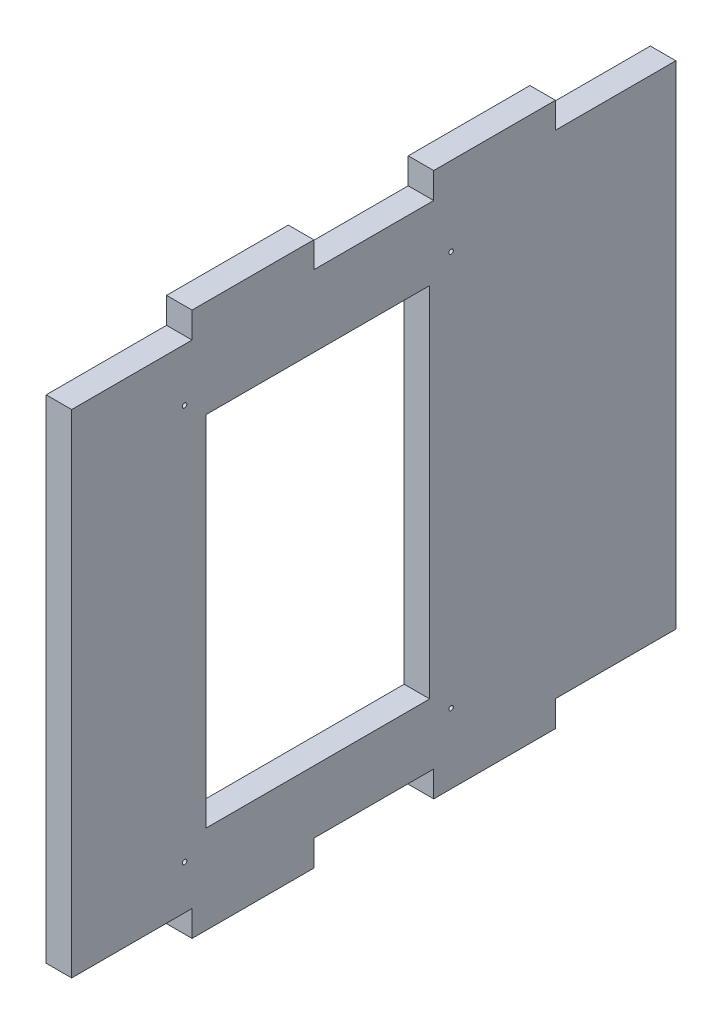
ISO-10303-21;
HEADER;
FILE_DESCRIPTION(('STEP AP214'),'2;1');
FILE_NAME('part.step','',(''),(''),'','','');
FILE_SCHEMA(('AUTOMOTIVE_DESIGN { 1 0 10303 214 1 1 1 1 }'));
ENDSEC;
DATA;
#1=APPLICATION_CONTEXT('core data for automotive mechanical design processes');
#2=APPLICATION_PROTOCOL_DEFINITION('international standard','automotive_design',2000,#1);
#3=PRODUCT_CONTEXT('',#1,'mechanical');
#4=PRODUCT('Part','Part','',(#3));
#5=PRODUCT_RELATED_PRODUCT_CATEGORY('part','',(#4));
#6=PRODUCT_DEFINITION_FORMATION('','',#4);
#7=PRODUCT_DEFINITION_CONTEXT('part definition',#1,'design');
#8=PRODUCT_DEFINITION('design','',#6,#7);
#9=PRODUCT_DEFINITION_SHAPE('','',#8);
#10=(LENGTH_UNIT() NAMED_UNIT(*) SI_UNIT(.MILLI.,.METRE.));
#11=(NAMED_UNIT(*) PLANE_ANGLE_UNIT() SI_UNIT($,.RADIAN.));
#12=(NAMED_UNIT(*) SI_UNIT($,.STERADIAN.) SOLID_ANGLE_UNIT());
#13=UNCERTAINTY_MEASURE_WITH_UNIT(LENGTH_MEASURE(1.E-05),#10,'distance_accuracy_value','');
#14=(GEOMETRIC_REPRESENTATION_CONTEXT(3) GLOBAL_UNCERTAINTY_ASSIGNED_CONTEXT((#13)) GLOBAL_UNIT_ASSIGNED_CONTEXT((#10,
#11,#12)) REPRESENTATION_CONTEXT('',''));
#15=CARTESIAN_POINT('',(0.,0.,0.));
#16=DIRECTION('',(0.,0.,1.));
#17=DIRECTION('',(1.,0.,0.));
#18=AXIS2_PLACEMENT_3D('',#15,#16,#17);
#19=CARTESIAN_POINT('',(5.7,0.,0.));
#20=DIRECTION('',(-1.,0.,0.));
#21=DIRECTION('',(0.,0.,1.));
#22=AXIS2_PLACEMENT_3D('',#19,#20,#21);
#23=PLANE('',#22);
#24=CARTESIAN_POINT('',(5.7,15.83,-84.77));
#25=DIRECTION('',(-1.,0.,0.));
#26=DIRECTION('',(0.,0.,1.));
#27=AXIS2_PLACEMENT_3D('',#24,#25,#26);
#28=CIRCLE('',#27,0.499999999999999);
#29=CARTESIAN_POINT('',(5.7,15.83,-84.27));
#30=VERTEX_POINT('',#29);
#31=EDGE_CURVE('E332',#30,#30,#28,.F.);
#32=ORIENTED_EDGE('',*,*,#31,.F.);
#33=EDGE_LOOP('',(#32));
#34=FACE_BOUND('',#33,.T.);
#35=CARTESIAN_POINT('',(5.7,15.83,-25.23));
#36=DIRECTION('',(-1.,0.,0.));
#37=DIRECTION('',(0.,0.,1.));
#38=AXIS2_PLACEMENT_3D('',#35,#36,#37);
#39=CIRCLE('',#38,0.499999999999999);
#40=CARTESIAN_POINT('',(5.7,15.83,-24.73));
#41=VERTEX_POINT('',#40);
#42=EDGE_CURVE('E338',#41,#41,#39,.F.);
#43=ORIENTED_EDGE('',*,*,#42,.F.);
#44=EDGE_LOOP('',(#43));
#45=FACE_BOUND('',#44,.T.);
#46=CARTESIAN_POINT('',(5.7,104.17,-84.77));
#47=DIRECTION('',(-1.,0.,0.));
#48=DIRECTION('',(0.,0.,1.));
#49=AXIS2_PLACEMENT_3D('',#46,#47,#48);
#50=CIRCLE('',#49,0.499999999999999);
#51=CARTESIAN_POINT('',(5.7,104.17,-84.27));
#52=VERTEX_POINT('',#51);
#53=EDGE_CURVE('E344',#52,#52,#50,.F.);
#54=ORIENTED_EDGE('',*,*,#53,.F.);
#55=EDGE_LOOP('',(#54));
#56=FACE_BOUND('',#55,.T.);
#57=CARTESIAN_POINT('',(5.7,104.17,-25.23));
#58=DIRECTION('',(-1.,0.,0.));
#59=DIRECTION('',(0.,0.,1.));
#60=AXIS2_PLACEMENT_3D('',#57,#58,#59);
#61=CIRCLE('',#60,0.499999999999999);
#62=CARTESIAN_POINT('',(5.7,104.17,-24.73));
#63=VERTEX_POINT('',#62);
#64=EDGE_CURVE('E350',#63,#63,#61,.F.);
#65=ORIENTED_EDGE('',*,*,#64,.F.);
#66=EDGE_LOOP('',(#65));
#67=FACE_BOUND('',#66,.T.);
#68=DIRECTION('',(0.,-1.,0.));
#69=VECTOR('',#68,1.);
#70=CARTESIAN_POINT('',(5.7,0.,-30.));
#71=LINE('',#70,#69);
#72=CARTESIAN_POINT('',(5.7,100.,-30.));
#73=VERTEX_POINT('',#72);
#74=CARTESIAN_POINT('',(5.7,20.,-30.));
#75=VERTEX_POINT('',#74);
#76=EDGE_CURVE('E381',#73,#75,#71,.T.);
#77=ORIENTED_EDGE('',*,*,#76,.F.);
#78=DIRECTION('',(0.,0.,1.));
#79=VECTOR('',#78,1.);
#80=CARTESIAN_POINT('',(5.7,100.,0.));
#81=LINE('',#80,#79);
#82=CARTESIAN_POINT('',(5.7,100.,-80.));
#83=VERTEX_POINT('',#82);
#84=EDGE_CURVE('E374',#83,#73,#81,.T.);
#85=ORIENTED_EDGE('',*,*,#84,.F.);
#86=DIRECTION('',(0.,1.,0.));
#87=VECTOR('',#86,1.);
#88=CARTESIAN_POINT('',(5.7,0.,-80.));
#89=LINE('',#88,#87);
#90=CARTESIAN_POINT('',(5.7,20.,-80.));
#91=VERTEX_POINT('',#90);
#92=EDGE_CURVE('E376',#91,#83,#89,.T.);
#93=ORIENTED_EDGE('',*,*,#92,.F.);
#94=DIRECTION('',(0.,0.,-1.));
#95=VECTOR('',#94,1.);
#96=CARTESIAN_POINT('',(5.7,20.,0.));
#97=LINE('',#96,#95);
#98=EDGE_CURVE('E379',#75,#91,#97,.T.);
#99=ORIENTED_EDGE('',*,*,#98,.F.);
#100=EDGE_LOOP('',(#77,#85,#93,#99));
#101=FACE_BOUND('',#100,.T.);
#102=DIRECTION('',(0.,0.,-1.));
#103=VECTOR('',#102,1.);
#104=CARTESIAN_POINT('',(5.70000000000001,5.99999999999999,0.));
#105=LINE('',#104,#103);
#106=CARTESIAN_POINT('',(5.70000000000001,5.99999999999999,0.));
#107=VERTEX_POINT('',#106);
#108=CARTESIAN_POINT('',(5.70000000000001,5.99999999999999,-26.9));
#109=VERTEX_POINT('',#108);
#110=EDGE_CURVE('E254',#107,#109,#105,.T.);
#111=ORIENTED_EDGE('',*,*,#110,.T.);
#112=DIRECTION('',(0.,-1.,0.));
#113=VECTOR('',#112,1.);
#114=CARTESIAN_POINT('',(5.70000000000001,5.99999999999999,-26.9));
#115=LINE('',#114,#113);
#116=CARTESIAN_POINT('',(5.70000000000001,0.199999999999992,-26.9));
#117=VERTEX_POINT('',#116);
#118=EDGE_CURVE('E437',#109,#117,#115,.T.);
#119=ORIENTED_EDGE('',*,*,#118,.T.);
#120=DIRECTION('',(0.,0.,-1.));
#121=VECTOR('',#120,1.);
#122=CARTESIAN_POINT('',(5.70000000000001,0.199999999999992,-26.9));
#123=LINE('',#122,#121);
#124=CARTESIAN_POINT('',(5.70000000000001,0.199999999999992,-54.1));
#125=VERTEX_POINT('',#124);
#126=EDGE_CURVE('E440',#117,#125,#123,.T.);
#127=ORIENTED_EDGE('',*,*,#126,.T.);
#128=DIRECTION('',(0.,1.,0.));
#129=VECTOR('',#128,1.);
#130=CARTESIAN_POINT('',(5.70000000000001,0.199999999999992,-54.1));
#131=LINE('',#130,#129);
#132=CARTESIAN_POINT('',(5.70000000000001,5.99999999999999,-54.1));
#133=VERTEX_POINT('',#132);
#134=EDGE_CURVE('E444',#125,#133,#131,.T.);
#135=ORIENTED_EDGE('',*,*,#134,.T.);
#136=DIRECTION('',(0.,0.,-1.));
#137=VECTOR('',#136,1.);
#138=CARTESIAN_POINT('',(5.70000000000001,5.99999999999999,-54.1));
#139=LINE('',#138,#137);
#140=CARTESIAN_POINT('',(5.70000000000001,5.99999999999999,-80.9));
#141=VERTEX_POINT('',#140);
#142=EDGE_CURVE('E447',#133,#141,#139,.T.);
#143=ORIENTED_EDGE('',*,*,#142,.T.);
#144=DIRECTION('',(0.,-1.,0.));
#145=VECTOR('',#144,1.);
#146=CARTESIAN_POINT('',(5.70000000000001,5.99999999999999,-80.9));
#147=LINE('',#146,#145);
#148=CARTESIAN_POINT('',(5.70000000000001,0.199999999999992,-80.9));
#149=VERTEX_POINT('',#148);
#150=EDGE_CURVE('E450',#141,#149,#147,.T.);
#151=ORIENTED_EDGE('',*,*,#150,.T.);
#152=DIRECTION('',(0.,0.,-1.));
#153=VECTOR('',#152,1.);
#154=CARTESIAN_POINT('',(5.70000000000001,0.199999999999992,-80.9));
#155=LINE('',#154,#153);
#156=CARTESIAN_POINT('',(5.70000000000001,0.199999999999992,-108.1));
#157=VERTEX_POINT('',#156);
#158=EDGE_CURVE('E453',#149,#157,#155,.T.);
#159=ORIENTED_EDGE('',*,*,#158,.T.);
#160=DIRECTION('',(0.,1.,0.));
#161=VECTOR('',#160,1.);
#162=CARTESIAN_POINT('',(5.70000000000001,0.199999999999992,-108.1));
#163=LINE('',#162,#161);
#164=CARTESIAN_POINT('',(5.70000000000001,5.99999999999999,-108.1));
#165=VERTEX_POINT('',#164);
#166=EDGE_CURVE('E455',#157,#165,#163,.T.);
#167=ORIENTED_EDGE('',*,*,#166,.T.);
#168=DIRECTION('',(0.,0.,-1.));
#169=VECTOR('',#168,1.);
#170=CARTESIAN_POINT('',(5.70000000000001,5.99999999999999,-108.1));
#171=LINE('',#170,#169);
#172=CARTESIAN_POINT('',(5.70000000000001,5.99999999999999,-135.));
#173=VERTEX_POINT('',#172);
#174=EDGE_CURVE('E197',#165,#173,#171,.T.);
#175=ORIENTED_EDGE('',*,*,#174,.T.);
#176=DIRECTION('',(0.,1.,0.));
#177=VECTOR('',#176,1.);
#178=CARTESIAN_POINT('',(5.7,0.,-135.));
#179=LINE('',#178,#177);
#180=CARTESIAN_POINT('',(5.7,116.,-135.));
#181=VERTEX_POINT('',#180);
#182=EDGE_CURVE('E11',#173,#181,#179,.T.);
#183=ORIENTED_EDGE('',*,*,#182,.T.);
#184=DIRECTION('',(0.,0.,1.));
#185=VECTOR('',#184,1.);
#186=CARTESIAN_POINT('',(5.70000000000001,116.,-108.1));
#187=LINE('',#186,#185);
#188=CARTESIAN_POINT('',(5.70000000000001,116.,-108.1));
#189=VERTEX_POINT('',#188);
#190=EDGE_CURVE('E255',#181,#189,#187,.T.);
#191=ORIENTED_EDGE('',*,*,#190,.T.);
#192=DIRECTION('',(0.,1.,0.));
#193=VECTOR('',#192,1.);
#194=CARTESIAN_POINT('',(5.70000000000001,121.8,-108.1));
#195=LINE('',#194,#193);
#196=CARTESIAN_POINT('',(5.70000000000001,121.8,-108.1));
#197=VERTEX_POINT('',#196);
#198=EDGE_CURVE('E257',#189,#197,#195,.T.);
#199=ORIENTED_EDGE('',*,*,#198,.T.);
#200=DIRECTION('',(0.,0.,1.));
#201=VECTOR('',#200,1.);
#202=CARTESIAN_POINT('',(5.70000000000001,121.8,-80.9));
#203=LINE('',#202,#201);
#204=CARTESIAN_POINT('',(5.70000000000001,121.8,-80.9));
#205=VERTEX_POINT('',#204);
#206=EDGE_CURVE('E261',#197,#205,#203,.T.);
#207=ORIENTED_EDGE('',*,*,#206,.T.);
#208=DIRECTION('',(0.,-1.,0.));
#209=VECTOR('',#208,1.);
#210=CARTESIAN_POINT('',(5.70000000000001,116.,-80.9));
#211=LINE('',#210,#209);
#212=CARTESIAN_POINT('',(5.70000000000001,116.,-80.9));
#213=VERTEX_POINT('',#212);
#214=EDGE_CURVE('E264',#205,#213,#211,.T.);
#215=ORIENTED_EDGE('',*,*,#214,.T.);
#216=DIRECTION('',(0.,0.,1.));
#217=VECTOR('',#216,1.);
#218=CARTESIAN_POINT('',(5.70000000000001,116.,-54.1));
#219=LINE('',#218,#217);
#220=CARTESIAN_POINT('',(5.70000000000001,116.,-54.1));
#221=VERTEX_POINT('',#220);
#222=EDGE_CURVE('E267',#213,#221,#219,.T.);
#223=ORIENTED_EDGE('',*,*,#222,.T.);
#224=DIRECTION('',(0.,1.,0.));
#225=VECTOR('',#224,1.);
#226=CARTESIAN_POINT('',(5.70000000000001,121.8,-54.1));
#227=LINE('',#226,#225);
#228=CARTESIAN_POINT('',(5.70000000000001,121.8,-54.1));
#229=VERTEX_POINT('',#228);
#230=EDGE_CURVE('E270',#221,#229,#227,.T.);
#231=ORIENTED_EDGE('',*,*,#230,.T.);
#232=DIRECTION('',(0.,0.,1.));
#233=VECTOR('',#232,1.);
#234=CARTESIAN_POINT('',(5.70000000000001,121.8,-26.9));
#235=LINE('',#234,#233);
#236=CARTESIAN_POINT('',(5.70000000000001,121.8,-26.9));
#237=VERTEX_POINT('',#236);
#238=EDGE_CURVE('E273',#229,#237,#235,.T.);
#239=ORIENTED_EDGE('',*,*,#238,.T.);
#240=DIRECTION('',(0.,-1.,0.));
#241=VECTOR('',#240,1.);
#242=CARTESIAN_POINT('',(5.70000000000001,116.,-26.9));
#243=LINE('',#242,#241);
#244=CARTESIAN_POINT('',(5.70000000000001,116.,-26.9));
#245=VERTEX_POINT('',#244);
#246=EDGE_CURVE('E276',#237,#245,#243,.T.);
#247=ORIENTED_EDGE('',*,*,#246,.T.);
#248=DIRECTION('',(0.,0.,1.));
#249=VECTOR('',#248,1.);
#250=CARTESIAN_POINT('',(5.70000000000001,116.,0.));
#251=LINE('',#250,#249);
#252=CARTESIAN_POINT('',(5.70000000000001,116.,0.));
#253=VERTEX_POINT('',#252);
#254=EDGE_CURVE('E279',#245,#253,#251,.T.);
#255=ORIENTED_EDGE('',*,*,#254,.T.);
#256=DIRECTION('',(0.,-1.,0.));
#257=VECTOR('',#256,1.);
#258=CARTESIAN_POINT('',(5.7,0.,0.));
#259=LINE('',#258,#257);
#260=EDGE_CURVE('E42',#253,#107,#259,.T.);
#261=ORIENTED_EDGE('',*,*,#260,.T.);
#262=EDGE_LOOP('',(#111,#119,#127,#135,#143,#151,#159,#167,#175,#183,#191,#199,#207,#215,#223,
#231,#239,#247,#255,#261));
#263=FACE_BOUND('',#262,.T.);
#264=ADVANCED_FACE('F33',(#34,#45,#56,#67,#101,#263),#23,.F.);
#265=CARTESIAN_POINT('',(0.,0.,0.));
#266=DIRECTION('',(-1.,0.,0.));
#267=DIRECTION('',(0.,0.,1.));
#268=AXIS2_PLACEMENT_3D('',#265,#266,#267);
#269=PLANE('',#268);
#270=CARTESIAN_POINT('',(0.,15.83,-84.77));
#271=DIRECTION('',(1.,0.,0.));
#272=DIRECTION('',(0.,0.,-1.));
#273=AXIS2_PLACEMENT_3D('',#270,#271,#272);
#274=CIRCLE('',#273,0.499999999999999);
#275=CARTESIAN_POINT('',(0.,15.83,-85.27));
#276=VERTEX_POINT('',#275);
#277=EDGE_CURVE('E282',#276,#276,#274,.T.);
#278=ORIENTED_EDGE('',*,*,#277,.T.);
#279=EDGE_LOOP('',(#278));
#280=FACE_BOUND('',#279,.T.);
#281=CARTESIAN_POINT('',(0.,15.83,-25.23));
#282=DIRECTION('',(1.,0.,0.));
#283=DIRECTION('',(0.,0.,-1.));
#284=AXIS2_PLACEMENT_3D('',#281,#282,#283);
#285=CIRCLE('',#284,0.499999999999999);
#286=CARTESIAN_POINT('',(0.,15.83,-25.73));
#287=VERTEX_POINT('',#286);
#288=EDGE_CURVE('E335',#287,#287,#285,.T.);
#289=ORIENTED_EDGE('',*,*,#288,.T.);
#290=EDGE_LOOP('',(#289));
#291=FACE_BOUND('',#290,.T.);
#292=CARTESIAN_POINT('',(0.,104.17,-84.77));
#293=DIRECTION('',(1.,0.,0.));
#294=DIRECTION('',(0.,0.,-1.));
#295=AXIS2_PLACEMENT_3D('',#292,#293,#294);
#296=CIRCLE('',#295,0.499999999999999);
#297=CARTESIAN_POINT('',(0.,104.17,-85.27));
#298=VERTEX_POINT('',#297);
#299=EDGE_CURVE('E341',#298,#298,#296,.T.);
#300=ORIENTED_EDGE('',*,*,#299,.T.);
#301=EDGE_LOOP('',(#300));
#302=FACE_BOUND('',#301,.T.);
#303=CARTESIAN_POINT('',(0.,104.17,-25.23));
#304=DIRECTION('',(1.,0.,0.));
#305=DIRECTION('',(0.,0.,-1.));
#306=AXIS2_PLACEMENT_3D('',#303,#304,#305);
#307=CIRCLE('',#306,0.499999999999999);
#308=CARTESIAN_POINT('',(0.,104.17,-25.73));
#309=VERTEX_POINT('',#308);
#310=EDGE_CURVE('E347',#309,#309,#307,.T.);
#311=ORIENTED_EDGE('',*,*,#310,.T.);
#312=EDGE_LOOP('',(#311));
#313=FACE_BOUND('',#312,.T.);
#314=DIRECTION('',(0.,0.,1.));
#315=VECTOR('',#314,1.);
#316=CARTESIAN_POINT('',(0.,100.,-30.));
#317=LINE('',#316,#315);
#318=CARTESIAN_POINT('',(0.,100.,-80.));
#319=VERTEX_POINT('',#318);
#320=CARTESIAN_POINT('',(0.,100.,-30.));
#321=VERTEX_POINT('',#320);
#322=EDGE_CURVE('E362',#319,#321,#317,.T.);
#323=ORIENTED_EDGE('',*,*,#322,.T.);
#324=DIRECTION('',(0.,-1.,0.));
#325=VECTOR('',#324,1.);
#326=CARTESIAN_POINT('',(0.,100.,-30.));
#327=LINE('',#326,#325);
#328=CARTESIAN_POINT('',(0.,20.,-30.));
#329=VERTEX_POINT('',#328);
#330=EDGE_CURVE('E353',#321,#329,#327,.T.);
#331=ORIENTED_EDGE('',*,*,#330,.T.);
#332=DIRECTION('',(0.,0.,-1.));
#333=VECTOR('',#332,1.);
#334=CARTESIAN_POINT('',(0.,20.,-30.));
#335=LINE('',#334,#333);
#336=CARTESIAN_POINT('',(0.,20.,-80.));
#337=VERTEX_POINT('',#336);
#338=EDGE_CURVE('E356',#329,#337,#335,.T.);
#339=ORIENTED_EDGE('',*,*,#338,.T.);
#340=DIRECTION('',(0.,1.,0.));
#341=VECTOR('',#340,1.);
#342=CARTESIAN_POINT('',(0.,100.,-80.));
#343=LINE('',#342,#341);
#344=EDGE_CURVE('E359',#337,#319,#343,.T.);
#345=ORIENTED_EDGE('',*,*,#344,.T.);
#346=EDGE_LOOP('',(#323,#331,#339,#345));
#347=FACE_BOUND('',#346,.T.);
#348=DIRECTION('',(0.,1.,0.));
#349=VECTOR('',#348,1.);
#350=CARTESIAN_POINT('',(0.,5.99999999999999,-26.9));
#351=LINE('',#350,#349);
#352=CARTESIAN_POINT('',(0.,0.199999999999992,-26.9));
#353=VERTEX_POINT('',#352);
#354=CARTESIAN_POINT('',(0.,5.99999999999999,-26.9));
#355=VERTEX_POINT('',#354);
#356=EDGE_CURVE('E233',#353,#355,#351,.T.);
#357=ORIENTED_EDGE('',*,*,#356,.T.);
#358=DIRECTION('',(0.,0.,1.));
#359=VECTOR('',#358,1.);
#360=CARTESIAN_POINT('',(0.,5.99999999999999,0.));
#361=LINE('',#360,#359);
#362=CARTESIAN_POINT('',(0.,5.99999999999999,0.));
#363=VERTEX_POINT('',#362);
#364=EDGE_CURVE('E235',#355,#363,#361,.T.);
#365=ORIENTED_EDGE('',*,*,#364,.T.);
#366=DIRECTION('',(0.,-1.,0.));
#367=VECTOR('',#366,1.);
#368=CARTESIAN_POINT('',(0.,0.,0.));
#369=LINE('',#368,#367);
#370=CARTESIAN_POINT('',(0.,116.,0.));
#371=VERTEX_POINT('',#370);
#372=EDGE_CURVE('E383',#371,#363,#369,.T.);
#373=ORIENTED_EDGE('',*,*,#372,.F.);
#374=DIRECTION('',(0.,0.,-1.));
#375=VECTOR('',#374,1.);
#376=CARTESIAN_POINT('',(0.,116.,0.));
#377=LINE('',#376,#375);
#378=CARTESIAN_POINT('',(0.,116.,-26.9));
#379=VERTEX_POINT('',#378);
#380=EDGE_CURVE('E283',#371,#379,#377,.T.);
#381=ORIENTED_EDGE('',*,*,#380,.T.);
#382=DIRECTION('',(0.,1.,0.));
#383=VECTOR('',#382,1.);
#384=CARTESIAN_POINT('',(0.,116.,-26.9));
#385=LINE('',#384,#383);
#386=CARTESIAN_POINT('',(0.,121.8,-26.9));
#387=VERTEX_POINT('',#386);
#388=EDGE_CURVE('E286',#379,#387,#385,.T.);
#389=ORIENTED_EDGE('',*,*,#388,.T.);
#390=DIRECTION('',(0.,0.,-1.));
#391=VECTOR('',#390,1.);
#392=CARTESIAN_POINT('',(0.,121.8,-26.9));
#393=LINE('',#392,#391);
#394=CARTESIAN_POINT('',(0.,121.8,-54.1));
#395=VERTEX_POINT('',#394);
#396=EDGE_CURVE('E289',#387,#395,#393,.T.);
#397=ORIENTED_EDGE('',*,*,#396,.T.);
#398=DIRECTION('',(0.,-1.,0.));
#399=VECTOR('',#398,1.);
#400=CARTESIAN_POINT('',(0.,121.8,-54.1));
#401=LINE('',#400,#399);
#402=CARTESIAN_POINT('',(0.,116.,-54.1));
#403=VERTEX_POINT('',#402);
#404=EDGE_CURVE('E292',#395,#403,#401,.T.);
#405=ORIENTED_EDGE('',*,*,#404,.T.);
#406=DIRECTION('',(0.,0.,-1.));
#407=VECTOR('',#406,1.);
#408=CARTESIAN_POINT('',(0.,116.,-54.1));
#409=LINE('',#408,#407);
#410=CARTESIAN_POINT('',(0.,116.,-80.9));
#411=VERTEX_POINT('',#410);
#412=EDGE_CURVE('E295',#403,#411,#409,.T.);
#413=ORIENTED_EDGE('',*,*,#412,.T.);
#414=DIRECTION('',(0.,1.,0.));
#415=VECTOR('',#414,1.);
#416=CARTESIAN_POINT('',(0.,116.,-80.9));
#417=LINE('',#416,#415);
#418=CARTESIAN_POINT('',(0.,121.8,-80.9));
#419=VERTEX_POINT('',#418);
#420=EDGE_CURVE('E298',#411,#419,#417,.T.);
#421=ORIENTED_EDGE('',*,*,#420,.T.);
#422=DIRECTION('',(0.,0.,-1.));
#423=VECTOR('',#422,1.);
#424=CARTESIAN_POINT('',(0.,121.8,-80.9));
#425=LINE('',#424,#423);
#426=CARTESIAN_POINT('',(0.,121.8,-108.1));
#427=VERTEX_POINT('',#426);
#428=EDGE_CURVE('E301',#419,#427,#425,.T.);
#429=ORIENTED_EDGE('',*,*,#428,.T.);
#430=DIRECTION('',(0.,-1.,0.));
#431=VECTOR('',#430,1.);
#432=CARTESIAN_POINT('',(0.,121.8,-108.1));
#433=LINE('',#432,#431);
#434=CARTESIAN_POINT('',(0.,116.,-108.1));
#435=VERTEX_POINT('',#434);
#436=EDGE_CURVE('E304',#427,#435,#433,.T.);
#437=ORIENTED_EDGE('',*,*,#436,.T.);
#438=DIRECTION('',(0.,0.,-1.));
#439=VECTOR('',#438,1.);
#440=CARTESIAN_POINT('',(0.,116.,-108.1));
#441=LINE('',#440,#439);
#442=CARTESIAN_POINT('',(0.,116.,-135.));
#443=VERTEX_POINT('',#442);
#444=EDGE_CURVE('E307',#435,#443,#441,.T.);
#445=ORIENTED_EDGE('',*,*,#444,.T.);
#446=DIRECTION('',(0.,1.,0.));
#447=VECTOR('',#446,1.);
#448=CARTESIAN_POINT('',(0.,0.,-135.));
#449=LINE('',#448,#447);
#450=CARTESIAN_POINT('',(0.,5.99999999999999,-135.));
#451=VERTEX_POINT('',#450);
#452=EDGE_CURVE('E37',#451,#443,#449,.T.);
#453=ORIENTED_EDGE('',*,*,#452,.F.);
#454=DIRECTION('',(0.,0.,1.));
#455=VECTOR('',#454,1.);
#456=CARTESIAN_POINT('',(0.,5.99999999999999,-108.1));
#457=LINE('',#456,#455);
#458=CARTESIAN_POINT('',(0.,5.99999999999999,-108.1));
#459=VERTEX_POINT('',#458);
#460=EDGE_CURVE('E50',#451,#459,#457,.T.);
#461=ORIENTED_EDGE('',*,*,#460,.T.);
#462=DIRECTION('',(0.,-1.,0.));
#463=VECTOR('',#462,1.);
#464=CARTESIAN_POINT('',(0.,0.199999999999992,-108.1));
#465=LINE('',#464,#463);
#466=CARTESIAN_POINT('',(0.,0.199999999999992,-108.1));
#467=VERTEX_POINT('',#466);
#468=EDGE_CURVE('E204',#459,#467,#465,.T.);
#469=ORIENTED_EDGE('',*,*,#468,.T.);
#470=DIRECTION('',(0.,0.,1.));
#471=VECTOR('',#470,1.);
#472=CARTESIAN_POINT('',(0.,0.199999999999992,-80.9));
#473=LINE('',#472,#471);
#474=CARTESIAN_POINT('',(0.,0.199999999999992,-80.9));
#475=VERTEX_POINT('',#474);
#476=EDGE_CURVE('E210',#467,#475,#473,.T.);
#477=ORIENTED_EDGE('',*,*,#476,.T.);
#478=DIRECTION('',(0.,1.,0.));
#479=VECTOR('',#478,1.);
#480=CARTESIAN_POINT('',(0.,5.99999999999999,-80.9));
#481=LINE('',#480,#479);
#482=CARTESIAN_POINT('',(0.,5.99999999999999,-80.9));
#483=VERTEX_POINT('',#482);
#484=EDGE_CURVE('E221',#475,#483,#481,.T.);
#485=ORIENTED_EDGE('',*,*,#484,.T.);
#486=DIRECTION('',(0.,0.,1.));
#487=VECTOR('',#486,1.);
#488=CARTESIAN_POINT('',(0.,5.99999999999999,-54.1));
#489=LINE('',#488,#487);
#490=CARTESIAN_POINT('',(0.,5.99999999999999,-54.1));
#491=VERTEX_POINT('',#490);
#492=EDGE_CURVE('E224',#483,#491,#489,.T.);
#493=ORIENTED_EDGE('',*,*,#492,.T.);
#494=DIRECTION('',(0.,-1.,0.));
#495=VECTOR('',#494,1.);
#496=CARTESIAN_POINT('',(0.,0.199999999999992,-54.1));
#497=LINE('',#496,#495);
#498=CARTESIAN_POINT('',(0.,0.199999999999992,-54.1));
#499=VERTEX_POINT('',#498);
#500=EDGE_CURVE('E227',#491,#499,#497,.T.);
#501=ORIENTED_EDGE('',*,*,#500,.T.);
#502=DIRECTION('',(0.,0.,1.));
#503=VECTOR('',#502,1.);
#504=CARTESIAN_POINT('',(0.,0.199999999999992,-26.9));
#505=LINE('',#504,#503);
#506=EDGE_CURVE('E230',#499,#353,#505,.T.);
#507=ORIENTED_EDGE('',*,*,#506,.T.);
#508=EDGE_LOOP('',(#357,#365,#373,#381,#389,#397,#405,#413,#421,#429,#437,#445,#453,#461,#469,
#477,#485,#493,#501,#507));
#509=FACE_BOUND('',#508,.T.);
#510=ADVANCED_FACE('F214',(#280,#291,#302,#313,#347,#509),#269,.T.);
#511=CARTESIAN_POINT('',(5.7,0.,0.));
#512=DIRECTION('',(0.,0.,-1.));
#513=DIRECTION('',(-1.,0.,0.));
#514=AXIS2_PLACEMENT_3D('',#511,#512,#513);
#515=PLANE('',#514);
#516=DIRECTION('',(-1.,0.,0.));
#517=VECTOR('',#516,1.);
#518=CARTESIAN_POINT('',(141.423984615837,5.99999999999999,0.));
#519=LINE('',#518,#517);
#520=EDGE_CURVE('E238',#107,#363,#519,.T.);
#521=ORIENTED_EDGE('',*,*,#520,.F.);
#522=ORIENTED_EDGE('',*,*,#260,.F.);
#523=DIRECTION('',(-1.,0.,0.));
#524=VECTOR('',#523,1.);
#525=CARTESIAN_POINT('',(141.423984615837,116.,0.));
#526=LINE('',#525,#524);
#527=EDGE_CURVE('E258',#253,#371,#526,.T.);
#528=ORIENTED_EDGE('',*,*,#527,.T.);
#529=ORIENTED_EDGE('',*,*,#372,.T.);
#530=EDGE_LOOP('',(#521,#522,#528,#529));
#531=FACE_BOUND('',#530,.T.);
#532=ADVANCED_FACE('F35',(#531),#515,.F.);
#533=CARTESIAN_POINT('',(5.7,0.,-135.));
#534=DIRECTION('',(0.,0.,1.));
#535=DIRECTION('',(1.,0.,0.));
#536=AXIS2_PLACEMENT_3D('',#533,#534,#535);
#537=PLANE('',#536);
#538=DIRECTION('',(-1.,0.,0.));
#539=VECTOR('',#538,1.);
#540=CARTESIAN_POINT('',(141.423984615837,5.99999999999999,-135.));
#541=LINE('',#540,#539);
#542=EDGE_CURVE('E200',#173,#451,#541,.T.);
#543=ORIENTED_EDGE('',*,*,#542,.T.);
#544=ORIENTED_EDGE('',*,*,#452,.T.);
#545=DIRECTION('',(-1.,0.,0.));
#546=VECTOR('',#545,1.);
#547=CARTESIAN_POINT('',(141.423984615837,116.,-135.));
#548=LINE('',#547,#546);
#549=EDGE_CURVE('E309',#181,#443,#548,.T.);
#550=ORIENTED_EDGE('',*,*,#549,.F.);
#551=ORIENTED_EDGE('',*,*,#182,.F.);
#552=EDGE_LOOP('',(#543,#544,#550,#551));
#553=FACE_BOUND('',#552,.T.);
#554=ADVANCED_FACE('F391',(#553),#537,.F.);
#555=CARTESIAN_POINT('',(70.,100.,-30.));
#556=DIRECTION('',(0.,0.,-1.));
#557=DIRECTION('',(-1.,0.,0.));
#558=AXIS2_PLACEMENT_3D('',#555,#556,#557);
#559=PLANE('',#558);
#560=ORIENTED_EDGE('',*,*,#76,.T.);
#561=DIRECTION('',(-1.,0.,0.));
#562=VECTOR('',#561,1.);
#563=CARTESIAN_POINT('',(70.,20.,-30.));
#564=LINE('',#563,#562);
#565=EDGE_CURVE('E372',#75,#329,#564,.T.);
#566=ORIENTED_EDGE('',*,*,#565,.T.);
#567=ORIENTED_EDGE('',*,*,#330,.F.);
#568=DIRECTION('',(-1.,0.,0.));
#569=VECTOR('',#568,1.);
#570=CARTESIAN_POINT('',(70.,100.,-30.));
#571=LINE('',#570,#569);
#572=EDGE_CURVE('E365',#73,#321,#571,.T.);
#573=ORIENTED_EDGE('',*,*,#572,.F.);
#574=EDGE_LOOP('',(#560,#566,#567,#573));
#575=FACE_BOUND('',#574,.T.);
#576=ADVANCED_FACE('F492',(#575),#559,.T.);
#577=CARTESIAN_POINT('',(70.,20.,-30.));
#578=DIRECTION('',(0.,1.,0.));
#579=DIRECTION('',(0.,0.,1.));
#580=AXIS2_PLACEMENT_3D('',#577,#578,#579);
#581=PLANE('',#580);
#582=ORIENTED_EDGE('',*,*,#98,.T.);
#583=DIRECTION('',(-1.,0.,0.));
#584=VECTOR('',#583,1.);
#585=CARTESIAN_POINT('',(70.,20.,-80.));
#586=LINE('',#585,#584);
#587=EDGE_CURVE('E370',#91,#337,#586,.T.);
#588=ORIENTED_EDGE('',*,*,#587,.T.);
#589=ORIENTED_EDGE('',*,*,#338,.F.);
#590=ORIENTED_EDGE('',*,*,#565,.F.);
#591=EDGE_LOOP('',(#582,#588,#589,#590));
#592=FACE_BOUND('',#591,.T.);
#593=ADVANCED_FACE('F499',(#592),#581,.T.);
#594=CARTESIAN_POINT('',(70.,100.,-80.));
#595=DIRECTION('',(0.,0.,1.));
#596=DIRECTION('',(1.,0.,0.));
#597=AXIS2_PLACEMENT_3D('',#594,#595,#596);
#598=PLANE('',#597);
#599=ORIENTED_EDGE('',*,*,#92,.T.);
#600=DIRECTION('',(-1.,0.,0.));
#601=VECTOR('',#600,1.);
#602=CARTESIAN_POINT('',(70.,100.,-80.));
#603=LINE('',#602,#601);
#604=EDGE_CURVE('E368',#83,#319,#603,.T.);
#605=ORIENTED_EDGE('',*,*,#604,.T.);
#606=ORIENTED_EDGE('',*,*,#344,.F.);
#607=ORIENTED_EDGE('',*,*,#587,.F.);
#608=EDGE_LOOP('',(#599,#605,#606,#607));
#609=FACE_BOUND('',#608,.T.);
#610=ADVANCED_FACE('F564',(#609),#598,.T.);
#611=CARTESIAN_POINT('',(70.,100.,-30.));
#612=DIRECTION('',(0.,-1.,0.));
#613=DIRECTION('',(0.,0.,-1.));
#614=AXIS2_PLACEMENT_3D('',#611,#612,#613);
#615=PLANE('',#614);
#616=ORIENTED_EDGE('',*,*,#84,.T.);
#617=ORIENTED_EDGE('',*,*,#572,.T.);
#618=ORIENTED_EDGE('',*,*,#322,.F.);
#619=ORIENTED_EDGE('',*,*,#604,.F.);
#620=EDGE_LOOP('',(#616,#617,#618,#619));
#621=FACE_BOUND('',#620,.T.);
#622=ADVANCED_FACE('F554',(#621),#615,.T.);
#623=CARTESIAN_POINT('',(52.,104.17,-25.23));
#624=DIRECTION('',(-1.,0.,0.));
#625=DIRECTION('',(0.,0.,1.));
#626=AXIS2_PLACEMENT_3D('',#623,#624,#625);
#627=CYLINDRICAL_SURFACE('',#626,0.499999999999999);
#628=ORIENTED_EDGE('',*,*,#310,.F.);
#629=EDGE_LOOP('',(#628));
#630=FACE_BOUND('',#629,.T.);
#631=ORIENTED_EDGE('',*,*,#64,.T.);
#632=EDGE_LOOP('',(#631));
#633=FACE_BOUND('',#632,.T.);
#634=ADVANCED_FACE('F544',(#630,#633),#627,.F.);
#635=CARTESIAN_POINT('',(52.,104.17,-84.77));
#636=DIRECTION('',(-1.,0.,0.));
#637=DIRECTION('',(0.,0.,1.));
#638=AXIS2_PLACEMENT_3D('',#635,#636,#637);
#639=CYLINDRICAL_SURFACE('',#638,0.499999999999999);
#640=ORIENTED_EDGE('',*,*,#299,.F.);
#641=EDGE_LOOP('',(#640));
#642=FACE_BOUND('',#641,.T.);
#643=ORIENTED_EDGE('',*,*,#53,.T.);
#644=EDGE_LOOP('',(#643));
#645=FACE_BOUND('',#644,.T.);
#646=ADVANCED_FACE('F534',(#642,#645),#639,.F.);
#647=CARTESIAN_POINT('',(52.,15.83,-25.23));
#648=DIRECTION('',(-1.,0.,0.));
#649=DIRECTION('',(0.,0.,1.));
#650=AXIS2_PLACEMENT_3D('',#647,#648,#649);
#651=CYLINDRICAL_SURFACE('',#650,0.499999999999999);
#652=ORIENTED_EDGE('',*,*,#288,.F.);
#653=EDGE_LOOP('',(#652));
#654=FACE_BOUND('',#653,.T.);
#655=ORIENTED_EDGE('',*,*,#42,.T.);
#656=EDGE_LOOP('',(#655));
#657=FACE_BOUND('',#656,.T.);
#658=ADVANCED_FACE('F522',(#654,#657),#651,.F.);
#659=CARTESIAN_POINT('',(52.,15.83,-84.77));
#660=DIRECTION('',(-1.,0.,0.));
#661=DIRECTION('',(0.,0.,1.));
#662=AXIS2_PLACEMENT_3D('',#659,#660,#661);
#663=CYLINDRICAL_SURFACE('',#662,0.499999999999999);
#664=ORIENTED_EDGE('',*,*,#277,.F.);
#665=EDGE_LOOP('',(#664));
#666=FACE_BOUND('',#665,.T.);
#667=ORIENTED_EDGE('',*,*,#31,.T.);
#668=EDGE_LOOP('',(#667));
#669=FACE_BOUND('',#668,.T.);
#670=ADVANCED_FACE('F517',(#666,#669),#663,.F.);
#671=CARTESIAN_POINT('',(141.423984615837,116.,-108.1));
#672=DIRECTION('',(0.,1.,0.));
#673=DIRECTION('',(0.,0.,1.));
#674=AXIS2_PLACEMENT_3D('',#671,#672,#673);
#675=PLANE('',#674);
#676=ORIENTED_EDGE('',*,*,#549,.T.);
#677=ORIENTED_EDGE('',*,*,#444,.F.);
#678=DIRECTION('',(-1.,0.,0.));
#679=VECTOR('',#678,1.);
#680=CARTESIAN_POINT('',(141.423984615837,116.,-108.1));
#681=LINE('',#680,#679);
#682=EDGE_CURVE('E312',#189,#435,#681,.T.);
#683=ORIENTED_EDGE('',*,*,#682,.F.);
#684=ORIENTED_EDGE('',*,*,#190,.F.);
#685=EDGE_LOOP('',(#676,#677,#683,#684));
#686=FACE_BOUND('',#685,.T.);
#687=ADVANCED_FACE('F394',(#686),#675,.T.);
#688=CARTESIAN_POINT('',(141.423984615837,121.8,-108.1));
#689=DIRECTION('',(0.,0.,-1.));
#690=DIRECTION('',(-1.,0.,0.));
#691=AXIS2_PLACEMENT_3D('',#688,#689,#690);
#692=PLANE('',#691);
#693=ORIENTED_EDGE('',*,*,#682,.T.);
#694=ORIENTED_EDGE('',*,*,#436,.F.);
#695=DIRECTION('',(-1.,0.,0.));
#696=VECTOR('',#695,1.);
#697=CARTESIAN_POINT('',(141.423984615837,121.8,-108.1));
#698=LINE('',#697,#696);
#699=EDGE_CURVE('E314',#197,#427,#698,.T.);
#700=ORIENTED_EDGE('',*,*,#699,.F.);
#701=ORIENTED_EDGE('',*,*,#198,.F.);
#702=EDGE_LOOP('',(#693,#694,#700,#701));
#703=FACE_BOUND('',#702,.T.);
#704=ADVANCED_FACE('F400',(#703),#692,.T.);
#705=CARTESIAN_POINT('',(141.423984615837,121.8,-80.9));
#706=DIRECTION('',(0.,1.,0.));
#707=DIRECTION('',(0.,0.,1.));
#708=AXIS2_PLACEMENT_3D('',#705,#706,#707);
#709=PLANE('',#708);
#710=ORIENTED_EDGE('',*,*,#699,.T.);
#711=ORIENTED_EDGE('',*,*,#428,.F.);
#712=DIRECTION('',(-1.,0.,0.));
#713=VECTOR('',#712,1.);
#714=CARTESIAN_POINT('',(141.423984615837,121.8,-80.9));
#715=LINE('',#714,#713);
#716=EDGE_CURVE('E316',#205,#419,#715,.T.);
#717=ORIENTED_EDGE('',*,*,#716,.F.);
#718=ORIENTED_EDGE('',*,*,#206,.F.);
#719=EDGE_LOOP('',(#710,#711,#717,#718));
#720=FACE_BOUND('',#719,.T.);
#721=ADVANCED_FACE('F404',(#720),#709,.T.);
#722=CARTESIAN_POINT('',(141.423984615837,116.,-80.9));
#723=DIRECTION('',(0.,0.,1.));
#724=DIRECTION('',(1.,0.,0.));
#725=AXIS2_PLACEMENT_3D('',#722,#723,#724);
#726=PLANE('',#725);
#727=ORIENTED_EDGE('',*,*,#716,.T.);
#728=ORIENTED_EDGE('',*,*,#420,.F.);
#729=DIRECTION('',(-1.,0.,0.));
#730=VECTOR('',#729,1.);
#731=CARTESIAN_POINT('',(141.423984615837,116.,-80.9));
#732=LINE('',#731,#730);
#733=EDGE_CURVE('E318',#213,#411,#732,.T.);
#734=ORIENTED_EDGE('',*,*,#733,.F.);
#735=ORIENTED_EDGE('',*,*,#214,.F.);
#736=EDGE_LOOP('',(#727,#728,#734,#735));
#737=FACE_BOUND('',#736,.T.);
#738=ADVANCED_FACE('F407',(#737),#726,.T.);
#739=CARTESIAN_POINT('',(141.423984615837,116.,-54.1));
#740=DIRECTION('',(0.,1.,0.));
#741=DIRECTION('',(0.,0.,1.));
#742=AXIS2_PLACEMENT_3D('',#739,#740,#741);
#743=PLANE('',#742);
#744=ORIENTED_EDGE('',*,*,#733,.T.);
#745=ORIENTED_EDGE('',*,*,#412,.F.);
#746=DIRECTION('',(-1.,0.,0.));
#747=VECTOR('',#746,1.);
#748=CARTESIAN_POINT('',(141.423984615837,116.,-54.1));
#749=LINE('',#748,#747);
#750=EDGE_CURVE('E320',#221,#403,#749,.T.);
#751=ORIENTED_EDGE('',*,*,#750,.F.);
#752=ORIENTED_EDGE('',*,*,#222,.F.);
#753=EDGE_LOOP('',(#744,#745,#751,#752));
#754=FACE_BOUND('',#753,.T.);
#755=ADVANCED_FACE('F411',(#754),#743,.T.);
#756=CARTESIAN_POINT('',(141.423984615837,121.8,-54.1));
#757=DIRECTION('',(0.,0.,-1.));
#758=DIRECTION('',(-1.,0.,0.));
#759=AXIS2_PLACEMENT_3D('',#756,#757,#758);
#760=PLANE('',#759);
#761=ORIENTED_EDGE('',*,*,#750,.T.);
#762=ORIENTED_EDGE('',*,*,#404,.F.);
#763=DIRECTION('',(-1.,0.,0.));
#764=VECTOR('',#763,1.);
#765=CARTESIAN_POINT('',(141.423984615837,121.8,-54.1));
#766=LINE('',#765,#764);
#767=EDGE_CURVE('E322',#229,#395,#766,.T.);
#768=ORIENTED_EDGE('',*,*,#767,.F.);
#769=ORIENTED_EDGE('',*,*,#230,.F.);
#770=EDGE_LOOP('',(#761,#762,#768,#769));
#771=FACE_BOUND('',#770,.T.);
#772=ADVANCED_FACE('F415',(#771),#760,.T.);
#773=CARTESIAN_POINT('',(141.423984615837,121.8,-26.9));
#774=DIRECTION('',(0.,1.,0.));
#775=DIRECTION('',(0.,0.,1.));
#776=AXIS2_PLACEMENT_3D('',#773,#774,#775);
#777=PLANE('',#776);
#778=ORIENTED_EDGE('',*,*,#767,.T.);
#779=ORIENTED_EDGE('',*,*,#396,.F.);
#780=DIRECTION('',(-1.,0.,0.));
#781=VECTOR('',#780,1.);
#782=CARTESIAN_POINT('',(141.423984615837,121.8,-26.9));
#783=LINE('',#782,#781);
#784=EDGE_CURVE('E324',#237,#387,#783,.T.);
#785=ORIENTED_EDGE('',*,*,#784,.F.);
#786=ORIENTED_EDGE('',*,*,#238,.F.);
#787=EDGE_LOOP('',(#778,#779,#785,#786));
#788=FACE_BOUND('',#787,.T.);
#789=ADVANCED_FACE('F419',(#788),#777,.T.);
#790=CARTESIAN_POINT('',(141.423984615837,116.,-26.9));
#791=DIRECTION('',(0.,0.,1.));
#792=DIRECTION('',(1.,0.,0.));
#793=AXIS2_PLACEMENT_3D('',#790,#791,#792);
#794=PLANE('',#793);
#795=ORIENTED_EDGE('',*,*,#784,.T.);
#796=ORIENTED_EDGE('',*,*,#388,.F.);
#797=DIRECTION('',(-1.,0.,0.));
#798=VECTOR('',#797,1.);
#799=CARTESIAN_POINT('',(141.423984615837,116.,-26.9));
#800=LINE('',#799,#798);
#801=EDGE_CURVE('E326',#245,#379,#800,.T.);
#802=ORIENTED_EDGE('',*,*,#801,.F.);
#803=ORIENTED_EDGE('',*,*,#246,.F.);
#804=EDGE_LOOP('',(#795,#796,#802,#803));
#805=FACE_BOUND('',#804,.T.);
#806=ADVANCED_FACE('F423',(#805),#794,.T.);
#807=CARTESIAN_POINT('',(141.423984615837,116.,0.));
#808=DIRECTION('',(0.,1.,0.));
#809=DIRECTION('',(0.,0.,1.));
#810=AXIS2_PLACEMENT_3D('',#807,#808,#809);
#811=PLANE('',#810);
#812=ORIENTED_EDGE('',*,*,#801,.T.);
#813=ORIENTED_EDGE('',*,*,#380,.F.);
#814=ORIENTED_EDGE('',*,*,#527,.F.);
#815=ORIENTED_EDGE('',*,*,#254,.F.);
#816=EDGE_LOOP('',(#812,#813,#814,#815));
#817=FACE_BOUND('',#816,.T.);
#818=ADVANCED_FACE('F593',(#817),#811,.T.);
#819=CARTESIAN_POINT('',(141.423984615837,5.99999999999999,0.));
#820=DIRECTION('',(0.,-1.,0.));
#821=DIRECTION('',(0.,0.,-1.));
#822=AXIS2_PLACEMENT_3D('',#819,#820,#821);
#823=PLANE('',#822);
#824=ORIENTED_EDGE('',*,*,#520,.T.);
#825=ORIENTED_EDGE('',*,*,#364,.F.);
#826=DIRECTION('',(-1.,0.,0.));
#827=VECTOR('',#826,1.);
#828=CARTESIAN_POINT('',(141.423984615837,5.99999999999999,-26.9));
#829=LINE('',#828,#827);
#830=EDGE_CURVE('E240',#109,#355,#829,.T.);
#831=ORIENTED_EDGE('',*,*,#830,.F.);
#832=ORIENTED_EDGE('',*,*,#110,.F.);
#833=EDGE_LOOP('',(#824,#825,#831,#832));
#834=FACE_BOUND('',#833,.T.);
#835=ADVANCED_FACE('F429',(#834),#823,.T.);
#836=CARTESIAN_POINT('',(141.423984615837,5.99999999999999,-26.9));
#837=DIRECTION('',(0.,0.,1.));
#838=DIRECTION('',(1.,0.,0.));
#839=AXIS2_PLACEMENT_3D('',#836,#837,#838);
#840=PLANE('',#839);
#841=ORIENTED_EDGE('',*,*,#830,.T.);
#842=ORIENTED_EDGE('',*,*,#356,.F.);
#843=DIRECTION('',(-1.,0.,0.));
#844=VECTOR('',#843,1.);
#845=CARTESIAN_POINT('',(141.423984615837,0.199999999999992,-26.9));
#846=LINE('',#845,#844);
#847=EDGE_CURVE('E242',#117,#353,#846,.T.);
#848=ORIENTED_EDGE('',*,*,#847,.F.);
#849=ORIENTED_EDGE('',*,*,#118,.F.);
#850=EDGE_LOOP('',(#841,#842,#848,#849));
#851=FACE_BOUND('',#850,.T.);
#852=ADVANCED_FACE('F435',(#851),#840,.T.);
#853=CARTESIAN_POINT('',(141.423984615837,0.199999999999992,-26.9));
#854=DIRECTION('',(0.,-1.,0.));
#855=DIRECTION('',(0.,0.,-1.));
#856=AXIS2_PLACEMENT_3D('',#853,#854,#855);
#857=PLANE('',#856);
#858=ORIENTED_EDGE('',*,*,#847,.T.);
#859=ORIENTED_EDGE('',*,*,#506,.F.);
#860=DIRECTION('',(-1.,0.,0.));
#861=VECTOR('',#860,1.);
#862=CARTESIAN_POINT('',(141.423984615837,0.199999999999992,-54.1));
#863=LINE('',#862,#861);
#864=EDGE_CURVE('E244',#125,#499,#863,.T.);
#865=ORIENTED_EDGE('',*,*,#864,.F.);
#866=ORIENTED_EDGE('',*,*,#126,.F.);
#867=EDGE_LOOP('',(#858,#859,#865,#866));
#868=FACE_BOUND('',#867,.T.);
#869=ADVANCED_FACE('F472',(#868),#857,.T.);
#870=CARTESIAN_POINT('',(141.423984615837,0.199999999999992,-54.1));
#871=DIRECTION('',(0.,0.,-1.));
#872=DIRECTION('',(-1.,0.,0.));
#873=AXIS2_PLACEMENT_3D('',#870,#871,#872);
#874=PLANE('',#873);
#875=ORIENTED_EDGE('',*,*,#864,.T.);
#876=ORIENTED_EDGE('',*,*,#500,.F.);
#877=DIRECTION('',(-1.,0.,0.));
#878=VECTOR('',#877,1.);
#879=CARTESIAN_POINT('',(141.423984615837,5.99999999999999,-54.1));
#880=LINE('',#879,#878);
#881=EDGE_CURVE('E246',#133,#491,#880,.T.);
#882=ORIENTED_EDGE('',*,*,#881,.F.);
#883=ORIENTED_EDGE('',*,*,#134,.F.);
#884=EDGE_LOOP('',(#875,#876,#882,#883));
#885=FACE_BOUND('',#884,.T.);
#886=ADVANCED_FACE('F469',(#885),#874,.T.);
#887=CARTESIAN_POINT('',(141.423984615837,5.99999999999999,-54.1));
#888=DIRECTION('',(0.,-1.,0.));
#889=DIRECTION('',(0.,0.,-1.));
#890=AXIS2_PLACEMENT_3D('',#887,#888,#889);
#891=PLANE('',#890);
#892=ORIENTED_EDGE('',*,*,#881,.T.);
#893=ORIENTED_EDGE('',*,*,#492,.F.);
#894=DIRECTION('',(-1.,0.,0.));
#895=VECTOR('',#894,1.);
#896=CARTESIAN_POINT('',(141.423984615837,5.99999999999999,-80.9));
#897=LINE('',#896,#895);
#898=EDGE_CURVE('E248',#141,#483,#897,.T.);
#899=ORIENTED_EDGE('',*,*,#898,.F.);
#900=ORIENTED_EDGE('',*,*,#142,.F.);
#901=EDGE_LOOP('',(#892,#893,#899,#900));
#902=FACE_BOUND('',#901,.T.);
#903=ADVANCED_FACE('F465',(#902),#891,.T.);
#904=CARTESIAN_POINT('',(141.423984615837,5.99999999999999,-80.9));
#905=DIRECTION('',(0.,0.,1.));
#906=DIRECTION('',(1.,0.,0.));
#907=AXIS2_PLACEMENT_3D('',#904,#905,#906);
#908=PLANE('',#907);
#909=ORIENTED_EDGE('',*,*,#898,.T.);
#910=ORIENTED_EDGE('',*,*,#484,.F.);
#911=DIRECTION('',(-1.,0.,0.));
#912=VECTOR('',#911,1.);
#913=CARTESIAN_POINT('',(141.423984615837,0.199999999999992,-80.9));
#914=LINE('',#913,#912);
#915=EDGE_CURVE('E250',#149,#475,#914,.T.);
#916=ORIENTED_EDGE('',*,*,#915,.F.);
#917=ORIENTED_EDGE('',*,*,#150,.F.);
#918=EDGE_LOOP('',(#909,#910,#916,#917));
#919=FACE_BOUND('',#918,.T.);
#920=ADVANCED_FACE('F462',(#919),#908,.T.);
#921=CARTESIAN_POINT('',(141.423984615837,0.199999999999992,-80.9));
#922=DIRECTION('',(0.,-1.,0.));
#923=DIRECTION('',(0.,0.,-1.));
#924=AXIS2_PLACEMENT_3D('',#921,#922,#923);
#925=PLANE('',#924);
#926=ORIENTED_EDGE('',*,*,#915,.T.);
#927=ORIENTED_EDGE('',*,*,#476,.F.);
#928=DIRECTION('',(-1.,0.,0.));
#929=VECTOR('',#928,1.);
#930=CARTESIAN_POINT('',(141.423984615837,0.199999999999992,-108.1));
#931=LINE('',#930,#929);
#932=EDGE_CURVE('E201',#157,#467,#931,.T.);
#933=ORIENTED_EDGE('',*,*,#932,.F.);
#934=ORIENTED_EDGE('',*,*,#158,.F.);
#935=EDGE_LOOP('',(#926,#927,#933,#934));
#936=FACE_BOUND('',#935,.T.);
#937=ADVANCED_FACE('F457',(#936),#925,.T.);
#938=CARTESIAN_POINT('',(141.423984615837,0.199999999999992,-108.1));
#939=DIRECTION('',(0.,0.,-1.));
#940=DIRECTION('',(-1.,0.,0.));
#941=AXIS2_PLACEMENT_3D('',#938,#939,#940);
#942=PLANE('',#941);
#943=ORIENTED_EDGE('',*,*,#932,.T.);
#944=ORIENTED_EDGE('',*,*,#468,.F.);
#945=DIRECTION('',(-1.,0.,0.));
#946=VECTOR('',#945,1.);
#947=CARTESIAN_POINT('',(141.423984615837,5.99999999999999,-108.1));
#948=LINE('',#947,#946);
#949=EDGE_CURVE('E194',#165,#459,#948,.T.);
#950=ORIENTED_EDGE('',*,*,#949,.F.);
#951=ORIENTED_EDGE('',*,*,#166,.F.);
#952=EDGE_LOOP('',(#943,#944,#950,#951));
#953=FACE_BOUND('',#952,.T.);
#954=ADVANCED_FACE('F205',(#953),#942,.T.);
#955=CARTESIAN_POINT('',(141.423984615837,5.99999999999999,-108.1));
#956=DIRECTION('',(0.,-1.,0.));
#957=DIRECTION('',(0.,0.,-1.));
#958=AXIS2_PLACEMENT_3D('',#955,#956,#957);
#959=PLANE('',#958);
#960=ORIENTED_EDGE('',*,*,#949,.T.);
#961=ORIENTED_EDGE('',*,*,#460,.F.);
#962=ORIENTED_EDGE('',*,*,#542,.F.);
#963=ORIENTED_EDGE('',*,*,#174,.F.);
#964=EDGE_LOOP('',(#960,#961,#962,#963));
#965=FACE_BOUND('',#964,.T.);
#966=ADVANCED_FACE('F196',(#965),#959,.T.);
#967=CLOSED_SHELL('',(#264,#510,#532,#554,#576,#593,#610,#622,#634,#646,#658,#670,#687,#704,
#721,#738,#755,#772,#789,#806,#818,#835,#852,#869,#886,#903,#920,#937,#954,#966));
#968=MANIFOLD_SOLID_BREP('B2',#967);
#969=ADVANCED_BREP_SHAPE_REPRESENTATION('',(#18,#968),#14);
#970=SHAPE_DEFINITION_REPRESENTATION(#9,#969);
ENDSEC;
END-ISO-10303-21;
